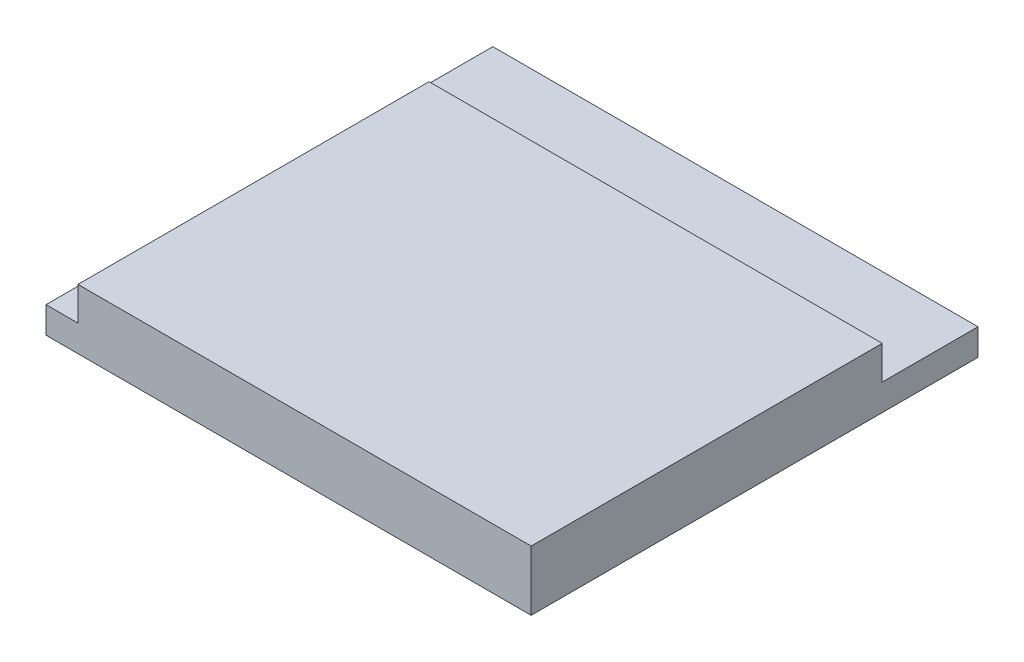
ISO-10303-21;
HEADER;
FILE_DESCRIPTION(('STEP AP214'),'2;1');
FILE_NAME('part.step','',(''),(''),'','','');
FILE_SCHEMA(('AUTOMOTIVE_DESIGN { 1 0 10303 214 1 1 1 1 }'));
ENDSEC;
DATA;
#1=APPLICATION_CONTEXT('core data for automotive mechanical design processes');
#2=APPLICATION_PROTOCOL_DEFINITION('international standard','automotive_design',2000,#1);
#3=PRODUCT_CONTEXT('',#1,'mechanical');
#4=PRODUCT('Part','Part','',(#3));
#5=PRODUCT_RELATED_PRODUCT_CATEGORY('part','',(#4));
#6=PRODUCT_DEFINITION_FORMATION('','',#4);
#7=PRODUCT_DEFINITION_CONTEXT('part definition',#1,'design');
#8=PRODUCT_DEFINITION('design','',#6,#7);
#9=PRODUCT_DEFINITION_SHAPE('','',#8);
#10=(LENGTH_UNIT() NAMED_UNIT(*) SI_UNIT(.MILLI.,.METRE.));
#11=(NAMED_UNIT(*) PLANE_ANGLE_UNIT() SI_UNIT($,.RADIAN.));
#12=(NAMED_UNIT(*) SI_UNIT($,.STERADIAN.) SOLID_ANGLE_UNIT());
#13=UNCERTAINTY_MEASURE_WITH_UNIT(LENGTH_MEASURE(1.E-05),#10,'distance_accuracy_value','');
#14=(GEOMETRIC_REPRESENTATION_CONTEXT(3) GLOBAL_UNCERTAINTY_ASSIGNED_CONTEXT((#13)) GLOBAL_UNIT_ASSIGNED_CONTEXT((#10,
#11,#12)) REPRESENTATION_CONTEXT('',''));
#15=CARTESIAN_POINT('',(0.,0.,0.));
#16=DIRECTION('',(0.,0.,1.));
#17=DIRECTION('',(1.,0.,0.));
#18=AXIS2_PLACEMENT_3D('',#15,#16,#17);
#19=CARTESIAN_POINT('',(7.6,0.83,-7.));
#20=DIRECTION('',(-1.,0.,0.));
#21=DIRECTION('',(0.,0.,1.));
#22=AXIS2_PLACEMENT_3D('',#19,#20,#21);
#23=PLANE('',#22);
#24=DIRECTION('',(0.,0.,-1.));
#25=VECTOR('',#24,1.);
#26=CARTESIAN_POINT('',(7.6,0.,-7.));
#27=LINE('',#26,#25);
#28=CARTESIAN_POINT('',(7.60000000000001,0.,7.));
#29=VERTEX_POINT('',#28);
#30=CARTESIAN_POINT('',(7.6,0.,-7.));
#31=VERTEX_POINT('',#30);
#32=EDGE_CURVE('E117',#29,#31,#27,.T.);
#33=ORIENTED_EDGE('',*,*,#32,.T.);
#34=DIRECTION('',(0.,-1.,0.));
#35=VECTOR('',#34,1.);
#36=CARTESIAN_POINT('',(7.6,0.83,-7.));
#37=LINE('',#36,#35);
#38=CARTESIAN_POINT('',(7.6,0.83,-7.));
#39=VERTEX_POINT('',#38);
#40=EDGE_CURVE('E11',#39,#31,#37,.T.);
#41=ORIENTED_EDGE('',*,*,#40,.F.);
#42=DIRECTION('',(0.,0.,-1.));
#43=VECTOR('',#42,1.);
#44=CARTESIAN_POINT('',(7.6,0.83,-7.));
#45=LINE('',#44,#43);
#46=CARTESIAN_POINT('',(7.6,0.83,-4.));
#47=VERTEX_POINT('',#46);
#48=EDGE_CURVE('E116',#47,#39,#45,.T.);
#49=ORIENTED_EDGE('',*,*,#48,.F.);
#50=DIRECTION('',(0.,-1.,0.));
#51=VECTOR('',#50,1.);
#52=CARTESIAN_POINT('',(7.60000000000001,1.88,-4.));
#53=LINE('',#52,#51);
#54=CARTESIAN_POINT('',(7.60000000000001,1.88,-4.));
#55=VERTEX_POINT('',#54);
#56=EDGE_CURVE('E97',#55,#47,#53,.T.);
#57=ORIENTED_EDGE('',*,*,#56,.F.);
#58=DIRECTION('',(0.,0.,-1.));
#59=VECTOR('',#58,1.);
#60=CARTESIAN_POINT('',(7.60000000000001,1.88,7.));
#61=LINE('',#60,#59);
#62=CARTESIAN_POINT('',(7.60000000000001,1.88,7.));
#63=VERTEX_POINT('',#62);
#64=EDGE_CURVE('E103',#63,#55,#61,.T.);
#65=ORIENTED_EDGE('',*,*,#64,.F.);
#66=DIRECTION('',(0.,-1.,0.));
#67=VECTOR('',#66,1.);
#68=CARTESIAN_POINT('',(7.60000000000001,0.83,7.));
#69=LINE('',#68,#67);
#70=EDGE_CURVE('E131',#63,#29,#69,.T.);
#71=ORIENTED_EDGE('',*,*,#70,.T.);
#72=EDGE_LOOP('',(#33,#41,#49,#57,#65,#71));
#73=FACE_BOUND('',#72,.T.);
#74=ADVANCED_FACE('F36',(#73),#23,.F.);
#75=CARTESIAN_POINT('',(-7.6,0.83,-7.));
#76=DIRECTION('',(0.,0.,1.));
#77=DIRECTION('',(1.,0.,0.));
#78=AXIS2_PLACEMENT_3D('',#75,#76,#77);
#79=PLANE('',#78);
#80=DIRECTION('',(-1.,0.,0.));
#81=VECTOR('',#80,1.);
#82=CARTESIAN_POINT('',(-7.6,0.,-7.));
#83=LINE('',#82,#81);
#84=CARTESIAN_POINT('',(-7.6,0.,-7.));
#85=VERTEX_POINT('',#84);
#86=EDGE_CURVE('E119',#31,#85,#83,.T.);
#87=ORIENTED_EDGE('',*,*,#86,.T.);
#88=DIRECTION('',(0.,-1.,0.));
#89=VECTOR('',#88,1.);
#90=CARTESIAN_POINT('',(-7.6,0.83,-7.));
#91=LINE('',#90,#89);
#92=CARTESIAN_POINT('',(-7.6,0.83,-7.));
#93=VERTEX_POINT('',#92);
#94=EDGE_CURVE('E43',#93,#85,#91,.T.);
#95=ORIENTED_EDGE('',*,*,#94,.F.);
#96=DIRECTION('',(-1.,0.,0.));
#97=VECTOR('',#96,1.);
#98=CARTESIAN_POINT('',(-7.6,0.83,-7.));
#99=LINE('',#98,#97);
#100=EDGE_CURVE('E126',#39,#93,#99,.T.);
#101=ORIENTED_EDGE('',*,*,#100,.F.);
#102=ORIENTED_EDGE('',*,*,#40,.T.);
#103=EDGE_LOOP('',(#87,#95,#101,#102));
#104=FACE_BOUND('',#103,.T.);
#105=ADVANCED_FACE('F155',(#104),#79,.F.);
#106=CARTESIAN_POINT('',(-7.6,0.83,-7.));
#107=DIRECTION('',(1.,0.,0.));
#108=DIRECTION('',(0.,0.,-1.));
#109=AXIS2_PLACEMENT_3D('',#106,#107,#108);
#110=PLANE('',#109);
#111=DIRECTION('',(0.,0.,1.));
#112=VECTOR('',#111,1.);
#113=CARTESIAN_POINT('',(-7.6,0.,-7.));
#114=LINE('',#113,#112);
#115=CARTESIAN_POINT('',(-7.6,0.,7.));
#116=VERTEX_POINT('',#115);
#117=EDGE_CURVE('E134',#85,#116,#114,.T.);
#118=ORIENTED_EDGE('',*,*,#117,.T.);
#119=DIRECTION('',(0.,-1.,0.));
#120=VECTOR('',#119,1.);
#121=CARTESIAN_POINT('',(-7.6,0.83,7.));
#122=LINE('',#121,#120);
#123=CARTESIAN_POINT('',(-7.6,0.83,7.));
#124=VERTEX_POINT('',#123);
#125=EDGE_CURVE('E138',#124,#116,#122,.T.);
#126=ORIENTED_EDGE('',*,*,#125,.F.);
#127=DIRECTION('',(0.,0.,1.));
#128=VECTOR('',#127,1.);
#129=CARTESIAN_POINT('',(-7.6,0.83,-7.));
#130=LINE('',#129,#128);
#131=EDGE_CURVE('E129',#93,#124,#130,.T.);
#132=ORIENTED_EDGE('',*,*,#131,.F.);
#133=ORIENTED_EDGE('',*,*,#94,.T.);
#134=EDGE_LOOP('',(#118,#126,#132,#133));
#135=FACE_BOUND('',#134,.T.);
#136=ADVANCED_FACE('F145',(#135),#110,.F.);
#137=CARTESIAN_POINT('',(-7.6,0.83,7.));
#138=DIRECTION('',(0.,0.,-1.));
#139=DIRECTION('',(-1.,0.,0.));
#140=AXIS2_PLACEMENT_3D('',#137,#138,#139);
#141=PLANE('',#140);
#142=DIRECTION('',(1.,0.,0.));
#143=VECTOR('',#142,1.);
#144=CARTESIAN_POINT('',(-7.6,0.,7.));
#145=LINE('',#144,#143);
#146=EDGE_CURVE('E127',#116,#29,#145,.T.);
#147=ORIENTED_EDGE('',*,*,#146,.T.);
#148=ORIENTED_EDGE('',*,*,#70,.F.);
#149=DIRECTION('',(1.,0.,0.));
#150=VECTOR('',#149,1.);
#151=CARTESIAN_POINT('',(7.60000000000001,1.88,7.));
#152=LINE('',#151,#150);
#153=CARTESIAN_POINT('',(-6.59999999999999,1.88,7.));
#154=VERTEX_POINT('',#153);
#155=EDGE_CURVE('E109',#154,#63,#152,.T.);
#156=ORIENTED_EDGE('',*,*,#155,.F.);
#157=DIRECTION('',(0.,-1.,0.));
#158=VECTOR('',#157,1.);
#159=CARTESIAN_POINT('',(-6.59999999999999,1.88,7.));
#160=LINE('',#159,#158);
#161=CARTESIAN_POINT('',(-6.59999999999999,0.83,7.));
#162=VERTEX_POINT('',#161);
#163=EDGE_CURVE('E121',#154,#162,#160,.T.);
#164=ORIENTED_EDGE('',*,*,#163,.T.);
#165=DIRECTION('',(1.,0.,0.));
#166=VECTOR('',#165,1.);
#167=CARTESIAN_POINT('',(-7.6,0.83,7.));
#168=LINE('',#167,#166);
#169=EDGE_CURVE('E50',#124,#162,#168,.T.);
#170=ORIENTED_EDGE('',*,*,#169,.F.);
#171=ORIENTED_EDGE('',*,*,#125,.T.);
#172=EDGE_LOOP('',(#147,#148,#156,#164,#170,#171));
#173=FACE_BOUND('',#172,.T.);
#174=ADVANCED_FACE('F154',(#173),#141,.F.);
#175=CARTESIAN_POINT('',(0.,0.83,0.));
#176=DIRECTION('',(0.,1.,0.));
#177=DIRECTION('',(0.,0.,1.));
#178=AXIS2_PLACEMENT_3D('',#175,#176,#177);
#179=PLANE('',#178);
#180=DIRECTION('',(0.,0.,1.));
#181=VECTOR('',#180,1.);
#182=CARTESIAN_POINT('',(-6.59999999999999,0.83,7.));
#183=LINE('',#182,#181);
#184=CARTESIAN_POINT('',(-6.59999999999999,0.83,-4.));
#185=VERTEX_POINT('',#184);
#186=EDGE_CURVE('E112',#185,#162,#183,.T.);
#187=ORIENTED_EDGE('',*,*,#186,.F.);
#188=DIRECTION('',(-1.,0.,0.));
#189=VECTOR('',#188,1.);
#190=CARTESIAN_POINT('',(7.60000000000001,0.83,-4.));
#191=LINE('',#190,#189);
#192=EDGE_CURVE('E56',#47,#185,#191,.T.);
#193=ORIENTED_EDGE('',*,*,#192,.F.);
#194=ORIENTED_EDGE('',*,*,#48,.T.);
#195=ORIENTED_EDGE('',*,*,#100,.T.);
#196=ORIENTED_EDGE('',*,*,#131,.T.);
#197=ORIENTED_EDGE('',*,*,#169,.T.);
#198=EDGE_LOOP('',(#187,#193,#194,#195,#196,#197));
#199=FACE_BOUND('',#198,.T.);
#200=ADVANCED_FACE('F156',(#199),#179,.T.);
#201=CARTESIAN_POINT('',(0.,0.,0.));
#202=DIRECTION('',(0.,1.,0.));
#203=DIRECTION('',(0.,0.,1.));
#204=AXIS2_PLACEMENT_3D('',#201,#202,#203);
#205=PLANE('',#204);
#206=ORIENTED_EDGE('',*,*,#32,.F.);
#207=ORIENTED_EDGE('',*,*,#146,.F.);
#208=ORIENTED_EDGE('',*,*,#117,.F.);
#209=ORIENTED_EDGE('',*,*,#86,.F.);
#210=EDGE_LOOP('',(#206,#207,#208,#209));
#211=FACE_BOUND('',#210,.T.);
#212=ADVANCED_FACE('F152',(#211),#205,.F.);
#213=CARTESIAN_POINT('',(7.60000000000001,1.88,-4.));
#214=DIRECTION('',(0.,0.,1.));
#215=DIRECTION('',(1.,0.,0.));
#216=AXIS2_PLACEMENT_3D('',#213,#214,#215);
#217=PLANE('',#216);
#218=ORIENTED_EDGE('',*,*,#192,.T.);
#219=DIRECTION('',(0.,-1.,0.));
#220=VECTOR('',#219,1.);
#221=CARTESIAN_POINT('',(-6.59999999999999,1.88,-4.));
#222=LINE('',#221,#220);
#223=CARTESIAN_POINT('',(-6.59999999999999,1.88,-4.));
#224=VERTEX_POINT('',#223);
#225=EDGE_CURVE('E99',#224,#185,#222,.T.);
#226=ORIENTED_EDGE('',*,*,#225,.F.);
#227=DIRECTION('',(-1.,0.,0.));
#228=VECTOR('',#227,1.);
#229=CARTESIAN_POINT('',(7.60000000000001,1.88,-4.));
#230=LINE('',#229,#228);
#231=EDGE_CURVE('E93',#55,#224,#230,.T.);
#232=ORIENTED_EDGE('',*,*,#231,.F.);
#233=ORIENTED_EDGE('',*,*,#56,.T.);
#234=EDGE_LOOP('',(#218,#226,#232,#233));
#235=FACE_BOUND('',#234,.T.);
#236=ADVANCED_FACE('F95',(#235),#217,.F.);
#237=CARTESIAN_POINT('',(-6.59999999999999,1.88,7.));
#238=DIRECTION('',(1.,0.,0.));
#239=DIRECTION('',(0.,0.,-1.));
#240=AXIS2_PLACEMENT_3D('',#237,#238,#239);
#241=PLANE('',#240);
#242=ORIENTED_EDGE('',*,*,#186,.T.);
#243=ORIENTED_EDGE('',*,*,#163,.F.);
#244=DIRECTION('',(0.,0.,1.));
#245=VECTOR('',#244,1.);
#246=CARTESIAN_POINT('',(-6.59999999999999,1.88,7.));
#247=LINE('',#246,#245);
#248=EDGE_CURVE('E102',#224,#154,#247,.T.);
#249=ORIENTED_EDGE('',*,*,#248,.F.);
#250=ORIENTED_EDGE('',*,*,#225,.T.);
#251=EDGE_LOOP('',(#242,#243,#249,#250));
#252=FACE_BOUND('',#251,.T.);
#253=ADVANCED_FACE('F164',(#252),#241,.F.);
#254=CARTESIAN_POINT('',(0.,1.88,0.));
#255=DIRECTION('',(0.,1.,0.));
#256=DIRECTION('',(0.,0.,1.));
#257=AXIS2_PLACEMENT_3D('',#254,#255,#256);
#258=PLANE('',#257);
#259=ORIENTED_EDGE('',*,*,#64,.T.);
#260=ORIENTED_EDGE('',*,*,#231,.T.);
#261=ORIENTED_EDGE('',*,*,#248,.T.);
#262=ORIENTED_EDGE('',*,*,#155,.T.);
#263=EDGE_LOOP('',(#259,#260,#261,#262));
#264=FACE_BOUND('',#263,.T.);
#265=ADVANCED_FACE('F107',(#264),#258,.T.);
#266=CLOSED_SHELL('',(#74,#105,#136,#174,#200,#212,#236,#253,#265));
#267=MANIFOLD_SOLID_BREP('B2',#266);
#268=ADVANCED_BREP_SHAPE_REPRESENTATION('',(#18,#267),#14);
#269=SHAPE_DEFINITION_REPRESENTATION(#9,#268);
ENDSEC;
END-ISO-10303-21;
